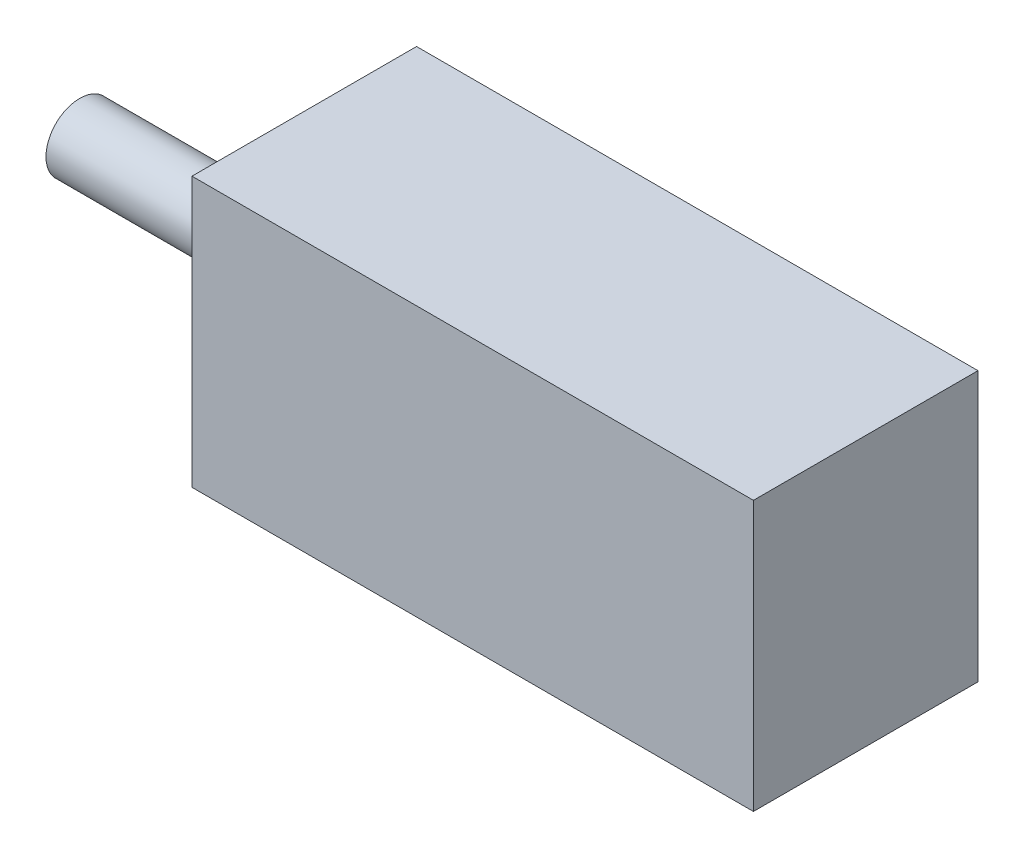
ISO-10303-21;
HEADER;
FILE_DESCRIPTION(('STEP AP214'),'2;1');
FILE_NAME('part.step','',(''),(''),'','','');
FILE_SCHEMA(('AUTOMOTIVE_DESIGN { 1 0 10303 214 1 1 1 1 }'));
ENDSEC;
DATA;
#1=APPLICATION_CONTEXT('core data for automotive mechanical design processes');
#2=APPLICATION_PROTOCOL_DEFINITION('international standard','automotive_design',2000,#1);
#3=PRODUCT_CONTEXT('',#1,'mechanical');
#4=PRODUCT('Part','Part','',(#3));
#5=PRODUCT_RELATED_PRODUCT_CATEGORY('part','',(#4));
#6=PRODUCT_DEFINITION_FORMATION('','',#4);
#7=PRODUCT_DEFINITION_CONTEXT('part definition',#1,'design');
#8=PRODUCT_DEFINITION('design','',#6,#7);
#9=PRODUCT_DEFINITION_SHAPE('','',#8);
#10=(LENGTH_UNIT() NAMED_UNIT(*) SI_UNIT(.MILLI.,.METRE.));
#11=(NAMED_UNIT(*) PLANE_ANGLE_UNIT() SI_UNIT($,.RADIAN.));
#12=(NAMED_UNIT(*) SI_UNIT($,.STERADIAN.) SOLID_ANGLE_UNIT());
#13=UNCERTAINTY_MEASURE_WITH_UNIT(LENGTH_MEASURE(1.E-05),#10,'distance_accuracy_value','');
#14=(GEOMETRIC_REPRESENTATION_CONTEXT(3) GLOBAL_UNCERTAINTY_ASSIGNED_CONTEXT((#13)) GLOBAL_UNIT_ASSIGNED_CONTEXT((#10,
#11,#12)) REPRESENTATION_CONTEXT('',''));
#15=CARTESIAN_POINT('',(0.,0.,0.));
#16=DIRECTION('',(0.,0.,1.));
#17=DIRECTION('',(1.,0.,0.));
#18=AXIS2_PLACEMENT_3D('',#15,#16,#17);
#19=CARTESIAN_POINT('',(-1.30952380952381,12.,-0.505952380952381));
#20=DIRECTION('',(1.,0.,0.));
#21=DIRECTION('',(0.,0.,-1.));
#22=AXIS2_PLACEMENT_3D('',#19,#20,#21);
#23=PLANE('',#22);
#24=DIRECTION('',(0.,0.,1.));
#25=VECTOR('',#24,1.);
#26=CARTESIAN_POINT('',(-1.30952380952381,0.,-0.505952380952381));
#27=LINE('',#26,#25);
#28=CARTESIAN_POINT('',(-1.30952380952381,0.,-0.505952380952381));
#29=VERTEX_POINT('',#28);
#30=CARTESIAN_POINT('',(-1.30952380952381,0.,9.49404761904762));
#31=VERTEX_POINT('',#30);
#32=EDGE_CURVE('E99',#29,#31,#27,.T.);
#33=ORIENTED_EDGE('',*,*,#32,.T.);
#34=DIRECTION('',(0.,-1.,0.));
#35=VECTOR('',#34,1.);
#36=CARTESIAN_POINT('',(-1.30952380952381,12.,9.49404761904762));
#37=LINE('',#36,#35);
#38=CARTESIAN_POINT('',(-1.30952380952381,12.,9.49404761904762));
#39=VERTEX_POINT('',#38);
#40=EDGE_CURVE('E41',#39,#31,#37,.T.);
#41=ORIENTED_EDGE('',*,*,#40,.F.);
#42=DIRECTION('',(0.,0.,1.));
#43=VECTOR('',#42,1.);
#44=CARTESIAN_POINT('',(-1.30952380952381,12.,-0.505952380952381));
#45=LINE('',#44,#43);
#46=CARTESIAN_POINT('',(-1.30952380952381,12.,-0.505952380952381));
#47=VERTEX_POINT('',#46);
#48=EDGE_CURVE('E85',#47,#39,#45,.T.);
#49=ORIENTED_EDGE('',*,*,#48,.F.);
#50=DIRECTION('',(0.,-1.,0.));
#51=VECTOR('',#50,1.);
#52=CARTESIAN_POINT('',(-1.30952380952381,12.,-0.505952380952381));
#53=LINE('',#52,#51);
#54=EDGE_CURVE('E95',#47,#29,#53,.T.);
#55=ORIENTED_EDGE('',*,*,#54,.T.);
#56=EDGE_LOOP('',(#33,#41,#49,#55));
#57=FACE_BOUND('',#56,.T.);
#58=CARTESIAN_POINT('',(-1.30952380952381,6.,4.49404761904762));
#59=DIRECTION('',(1.,0.,0.));
#60=DIRECTION('',(0.,0.,-1.));
#61=AXIS2_PLACEMENT_3D('',#58,#59,#60);
#62=CIRCLE('',#61,1.5);
#63=CARTESIAN_POINT('',(-1.30952380952381,6.,2.99404761904762));
#64=VERTEX_POINT('',#63);
#65=EDGE_CURVE('E11',#64,#64,#62,.F.);
#66=ORIENTED_EDGE('',*,*,#65,.F.);
#67=EDGE_LOOP('',(#66));
#68=FACE_BOUND('',#67,.T.);
#69=ADVANCED_FACE('F33',(#57,#68),#23,.F.);
#70=CARTESIAN_POINT('',(-1.30952380952381,12.,9.49404761904762));
#71=DIRECTION('',(0.,0.,-1.));
#72=DIRECTION('',(-1.,0.,0.));
#73=AXIS2_PLACEMENT_3D('',#70,#71,#72);
#74=PLANE('',#73);
#75=DIRECTION('',(1.,0.,0.));
#76=VECTOR('',#75,1.);
#77=CARTESIAN_POINT('',(-1.30952380952381,0.,9.49404761904762));
#78=LINE('',#77,#76);
#79=CARTESIAN_POINT('',(23.6904761904762,0.,9.49404761904762));
#80=VERTEX_POINT('',#79);
#81=EDGE_CURVE('E90',#31,#80,#78,.T.);
#82=ORIENTED_EDGE('',*,*,#81,.T.);
#83=DIRECTION('',(0.,-1.,0.));
#84=VECTOR('',#83,1.);
#85=CARTESIAN_POINT('',(23.6904761904762,12.,9.49404761904762));
#86=LINE('',#85,#84);
#87=CARTESIAN_POINT('',(23.6904761904762,12.,9.49404761904762));
#88=VERTEX_POINT('',#87);
#89=EDGE_CURVE('E88',#88,#80,#86,.T.);
#90=ORIENTED_EDGE('',*,*,#89,.F.);
#91=DIRECTION('',(1.,0.,0.));
#92=VECTOR('',#91,1.);
#93=CARTESIAN_POINT('',(-1.30952380952381,12.,9.49404761904762));
#94=LINE('',#93,#92);
#95=EDGE_CURVE('E80',#39,#88,#94,.T.);
#96=ORIENTED_EDGE('',*,*,#95,.F.);
#97=ORIENTED_EDGE('',*,*,#40,.T.);
#98=EDGE_LOOP('',(#82,#90,#96,#97));
#99=FACE_BOUND('',#98,.T.);
#100=ADVANCED_FACE('F89',(#99),#74,.F.);
#101=CARTESIAN_POINT('',(23.6904761904762,12.,-0.505952380952381));
#102=DIRECTION('',(-1.,0.,0.));
#103=DIRECTION('',(0.,0.,1.));
#104=AXIS2_PLACEMENT_3D('',#101,#102,#103);
#105=PLANE('',#104);
#106=DIRECTION('',(0.,0.,-1.));
#107=VECTOR('',#106,1.);
#108=CARTESIAN_POINT('',(23.6904761904762,0.,-0.505952380952381));
#109=LINE('',#108,#107);
#110=CARTESIAN_POINT('',(23.6904761904762,0.,-0.505952380952381));
#111=VERTEX_POINT('',#110);
#112=EDGE_CURVE('E66',#80,#111,#109,.T.);
#113=ORIENTED_EDGE('',*,*,#112,.T.);
#114=DIRECTION('',(0.,-1.,0.));
#115=VECTOR('',#114,1.);
#116=CARTESIAN_POINT('',(23.6904761904762,12.,-0.505952380952381));
#117=LINE('',#116,#115);
#118=CARTESIAN_POINT('',(23.6904761904762,12.,-0.505952380952381));
#119=VERTEX_POINT('',#118);
#120=EDGE_CURVE('E91',#119,#111,#117,.T.);
#121=ORIENTED_EDGE('',*,*,#120,.F.);
#122=DIRECTION('',(0.,0.,-1.));
#123=VECTOR('',#122,1.);
#124=CARTESIAN_POINT('',(23.6904761904762,12.,-0.505952380952381));
#125=LINE('',#124,#123);
#126=EDGE_CURVE('E83',#88,#119,#125,.T.);
#127=ORIENTED_EDGE('',*,*,#126,.F.);
#128=ORIENTED_EDGE('',*,*,#89,.T.);
#129=EDGE_LOOP('',(#113,#121,#127,#128));
#130=FACE_BOUND('',#129,.T.);
#131=ADVANCED_FACE('F93',(#130),#105,.F.);
#132=CARTESIAN_POINT('',(-1.30952380952381,12.,-0.505952380952381));
#133=DIRECTION('',(0.,0.,1.));
#134=DIRECTION('',(1.,0.,0.));
#135=AXIS2_PLACEMENT_3D('',#132,#133,#134);
#136=PLANE('',#135);
#137=DIRECTION('',(-1.,0.,0.));
#138=VECTOR('',#137,1.);
#139=CARTESIAN_POINT('',(-1.30952380952381,0.,-0.505952380952381));
#140=LINE('',#139,#138);
#141=EDGE_CURVE('E72',#111,#29,#140,.T.);
#142=ORIENTED_EDGE('',*,*,#141,.T.);
#143=ORIENTED_EDGE('',*,*,#54,.F.);
#144=DIRECTION('',(-1.,0.,0.));
#145=VECTOR('',#144,1.);
#146=CARTESIAN_POINT('',(-1.30952380952381,12.,-0.505952380952381));
#147=LINE('',#146,#145);
#148=EDGE_CURVE('E49',#119,#47,#147,.T.);
#149=ORIENTED_EDGE('',*,*,#148,.F.);
#150=ORIENTED_EDGE('',*,*,#120,.T.);
#151=EDGE_LOOP('',(#142,#143,#149,#150));
#152=FACE_BOUND('',#151,.T.);
#153=ADVANCED_FACE('F122',(#152),#136,.F.);
#154=CARTESIAN_POINT('',(0.,12.,0.));
#155=DIRECTION('',(0.,1.,0.));
#156=DIRECTION('',(0.,0.,1.));
#157=AXIS2_PLACEMENT_3D('',#154,#155,#156);
#158=PLANE('',#157);
#159=ORIENTED_EDGE('',*,*,#48,.T.);
#160=ORIENTED_EDGE('',*,*,#95,.T.);
#161=ORIENTED_EDGE('',*,*,#126,.T.);
#162=ORIENTED_EDGE('',*,*,#148,.T.);
#163=EDGE_LOOP('',(#159,#160,#161,#162));
#164=FACE_BOUND('',#163,.T.);
#165=ADVANCED_FACE('F81',(#164),#158,.T.);
#166=CARTESIAN_POINT('',(0.,0.,0.));
#167=DIRECTION('',(0.,1.,0.));
#168=DIRECTION('',(0.,0.,1.));
#169=AXIS2_PLACEMENT_3D('',#166,#167,#168);
#170=PLANE('',#169);
#171=ORIENTED_EDGE('',*,*,#32,.F.);
#172=ORIENTED_EDGE('',*,*,#141,.F.);
#173=ORIENTED_EDGE('',*,*,#112,.F.);
#174=ORIENTED_EDGE('',*,*,#81,.F.);
#175=EDGE_LOOP('',(#171,#172,#173,#174));
#176=FACE_BOUND('',#175,.T.);
#177=ADVANCED_FACE('F111',(#176),#170,.F.);
#178=CARTESIAN_POINT('',(-11.3095238095238,6.,4.49404761904762));
#179=DIRECTION('',(1.,0.,0.));
#180=DIRECTION('',(0.,0.,-1.));
#181=AXIS2_PLACEMENT_3D('',#178,#179,#180);
#182=CYLINDRICAL_SURFACE('',#181,1.5);
#183=CARTESIAN_POINT('',(-11.3095238095238,6.,4.49404761904762));
#184=DIRECTION('',(-1.,0.,0.));
#185=DIRECTION('',(0.,0.,1.));
#186=AXIS2_PLACEMENT_3D('',#183,#184,#185);
#187=CIRCLE('',#186,1.5);
#188=CARTESIAN_POINT('',(-11.3095238095238,6.,5.99404761904762));
#189=VERTEX_POINT('',#188);
#190=EDGE_CURVE('E102',#189,#189,#187,.T.);
#191=ORIENTED_EDGE('',*,*,#190,.F.);
#192=EDGE_LOOP('',(#191));
#193=FACE_BOUND('',#192,.T.);
#194=ORIENTED_EDGE('',*,*,#65,.T.);
#195=EDGE_LOOP('',(#194));
#196=FACE_BOUND('',#195,.T.);
#197=ADVANCED_FACE('F113',(#193,#196),#182,.T.);
#198=CARTESIAN_POINT('',(-11.3095238095238,6.,4.49404761904762));
#199=DIRECTION('',(-1.,0.,0.));
#200=DIRECTION('',(0.,0.,1.));
#201=AXIS2_PLACEMENT_3D('',#198,#199,#200);
#202=PLANE('',#201);
#203=ORIENTED_EDGE('',*,*,#190,.T.);
#204=EDGE_LOOP('',(#203));
#205=FACE_BOUND('',#204,.T.);
#206=ADVANCED_FACE('F119',(#205),#202,.T.);
#207=CLOSED_SHELL('',(#69,#100,#131,#153,#165,#177,#197,#206));
#208=MANIFOLD_SOLID_BREP('B2',#207);
#209=ADVANCED_BREP_SHAPE_REPRESENTATION('',(#18,#208),#14);
#210=SHAPE_DEFINITION_REPRESENTATION(#9,#209);
ENDSEC;
END-ISO-10303-21;
